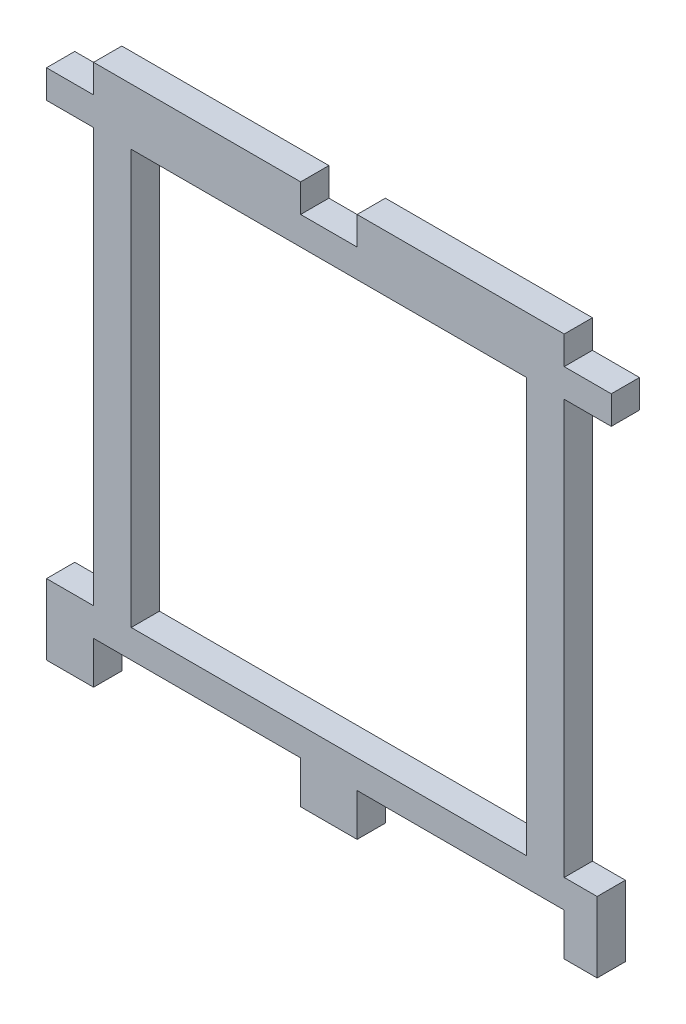
ISO-10303-21;
HEADER;
FILE_DESCRIPTION(('STEP AP214'),'2;1');
FILE_NAME('part.step','',(''),(''),'','','');
FILE_SCHEMA(('AUTOMOTIVE_DESIGN { 1 0 10303 214 1 1 1 1 }'));
ENDSEC;
DATA;
#1=APPLICATION_CONTEXT('core data for automotive mechanical design processes');
#2=APPLICATION_PROTOCOL_DEFINITION('international standard','automotive_design',2000,#1);
#3=PRODUCT_CONTEXT('',#1,'mechanical');
#4=PRODUCT('Part','Part','',(#3));
#5=PRODUCT_RELATED_PRODUCT_CATEGORY('part','',(#4));
#6=PRODUCT_DEFINITION_FORMATION('','',#4);
#7=PRODUCT_DEFINITION_CONTEXT('part definition',#1,'design');
#8=PRODUCT_DEFINITION('design','',#6,#7);
#9=PRODUCT_DEFINITION_SHAPE('','',#8);
#10=(LENGTH_UNIT() NAMED_UNIT(*) SI_UNIT(.MILLI.,.METRE.));
#11=(NAMED_UNIT(*) PLANE_ANGLE_UNIT() SI_UNIT($,.RADIAN.));
#12=(NAMED_UNIT(*) SI_UNIT($,.STERADIAN.) SOLID_ANGLE_UNIT());
#13=UNCERTAINTY_MEASURE_WITH_UNIT(LENGTH_MEASURE(1.E-05),#10,'distance_accuracy_value','');
#14=(GEOMETRIC_REPRESENTATION_CONTEXT(3) GLOBAL_UNCERTAINTY_ASSIGNED_CONTEXT((#13)) GLOBAL_UNIT_ASSIGNED_CONTEXT((#10,
#11,#12)) REPRESENTATION_CONTEXT('',''));
#15=CARTESIAN_POINT('',(0.,0.,0.));
#16=DIRECTION('',(0.,0.,1.));
#17=DIRECTION('',(1.,0.,0.));
#18=AXIS2_PLACEMENT_3D('',#15,#16,#17);
#19=CARTESIAN_POINT('',(0.,0.,3.));
#20=DIRECTION('',(0.,0.,1.));
#21=DIRECTION('',(1.,0.,0.));
#22=AXIS2_PLACEMENT_3D('',#19,#20,#21);
#23=PLANE('',#22);
#24=DIRECTION('',(0.,-1.,0.));
#25=VECTOR('',#24,1.);
#26=CARTESIAN_POINT('',(0.,0.,3.));
#27=LINE('',#26,#25);
#28=CARTESIAN_POINT('',(0.,0.,3.));
#29=VERTEX_POINT('',#28);
#30=CARTESIAN_POINT('',(0.,-3.,3.));
#31=VERTEX_POINT('',#30);
#32=EDGE_CURVE('E280',#29,#31,#27,.T.);
#33=ORIENTED_EDGE('',*,*,#32,.T.);
#34=DIRECTION('',(1.,0.,0.));
#35=VECTOR('',#34,1.);
#36=CARTESIAN_POINT('',(0.,-3.,3.));
#37=LINE('',#36,#35);
#38=CARTESIAN_POINT('',(5.,-3.00000000000001,3.));
#39=VERTEX_POINT('',#38);
#40=EDGE_CURVE('E283',#31,#39,#37,.T.);
#41=ORIENTED_EDGE('',*,*,#40,.T.);
#42=DIRECTION('',(0.,-1.,0.));
#43=VECTOR('',#42,1.);
#44=CARTESIAN_POINT('',(5.,-3.00000000000001,3.));
#45=LINE('',#44,#43);
#46=CARTESIAN_POINT('',(5.,-47.,3.));
#47=VERTEX_POINT('',#46);
#48=EDGE_CURVE('E286',#39,#47,#45,.T.);
#49=ORIENTED_EDGE('',*,*,#48,.T.);
#50=DIRECTION('',(-1.,0.,0.));
#51=VECTOR('',#50,1.);
#52=CARTESIAN_POINT('',(0.,-47.,3.));
#53=LINE('',#52,#51);
#54=CARTESIAN_POINT('',(0.,-47.,3.));
#55=VERTEX_POINT('',#54);
#56=EDGE_CURVE('E288',#47,#55,#53,.T.);
#57=ORIENTED_EDGE('',*,*,#56,.T.);
#58=DIRECTION('',(0.,-1.,0.));
#59=VECTOR('',#58,1.);
#60=CARTESIAN_POINT('',(0.,-54.5,3.));
#61=LINE('',#60,#59);
#62=CARTESIAN_POINT('',(0.,-54.5,3.));
#63=VERTEX_POINT('',#62);
#64=EDGE_CURVE('E290',#55,#63,#61,.T.);
#65=ORIENTED_EDGE('',*,*,#64,.T.);
#66=DIRECTION('',(1.,0.,0.));
#67=VECTOR('',#66,1.);
#68=CARTESIAN_POINT('',(5.00000000000001,-54.5,3.));
#69=LINE('',#68,#67);
#70=CARTESIAN_POINT('',(5.00000000000001,-54.5,3.));
#71=VERTEX_POINT('',#70);
#72=EDGE_CURVE('E292',#63,#71,#69,.T.);
#73=ORIENTED_EDGE('',*,*,#72,.T.);
#74=DIRECTION('',(0.,1.,0.));
#75=VECTOR('',#74,1.);
#76=CARTESIAN_POINT('',(5.00000000000001,-50.,3.));
#77=LINE('',#76,#75);
#78=CARTESIAN_POINT('',(5.00000000000001,-50.,3.));
#79=VERTEX_POINT('',#78);
#80=EDGE_CURVE('E294',#71,#79,#77,.T.);
#81=ORIENTED_EDGE('',*,*,#80,.T.);
#82=DIRECTION('',(1.,0.,0.));
#83=VECTOR('',#82,1.);
#84=CARTESIAN_POINT('',(27.,-50.,3.));
#85=LINE('',#84,#83);
#86=CARTESIAN_POINT('',(27.,-50.,3.));
#87=VERTEX_POINT('',#86);
#88=EDGE_CURVE('E296',#79,#87,#85,.T.);
#89=ORIENTED_EDGE('',*,*,#88,.T.);
#90=DIRECTION('',(0.,-1.,0.));
#91=VECTOR('',#90,1.);
#92=CARTESIAN_POINT('',(27.,-54.5,3.));
#93=LINE('',#92,#91);
#94=CARTESIAN_POINT('',(27.,-54.5,3.));
#95=VERTEX_POINT('',#94);
#96=EDGE_CURVE('E298',#87,#95,#93,.T.);
#97=ORIENTED_EDGE('',*,*,#96,.T.);
#98=DIRECTION('',(1.,0.,0.));
#99=VECTOR('',#98,1.);
#100=CARTESIAN_POINT('',(33.,-54.5,3.));
#101=LINE('',#100,#99);
#102=CARTESIAN_POINT('',(33.,-54.5,3.));
#103=VERTEX_POINT('',#102);
#104=EDGE_CURVE('E300',#95,#103,#101,.T.);
#105=ORIENTED_EDGE('',*,*,#104,.T.);
#106=DIRECTION('',(0.,1.,0.));
#107=VECTOR('',#106,1.);
#108=CARTESIAN_POINT('',(33.,-50.,3.));
#109=LINE('',#108,#107);
#110=CARTESIAN_POINT('',(33.,-50.,3.));
#111=VERTEX_POINT('',#110);
#112=EDGE_CURVE('E302',#103,#111,#109,.T.);
#113=ORIENTED_EDGE('',*,*,#112,.T.);
#114=DIRECTION('',(1.,0.,0.));
#115=VECTOR('',#114,1.);
#116=CARTESIAN_POINT('',(55.,-50.,3.));
#117=LINE('',#116,#115);
#118=CARTESIAN_POINT('',(55.,-50.,3.));
#119=VERTEX_POINT('',#118);
#120=EDGE_CURVE('E304',#111,#119,#117,.T.);
#121=ORIENTED_EDGE('',*,*,#120,.T.);
#122=DIRECTION('',(0.,-1.,0.));
#123=VECTOR('',#122,1.);
#124=CARTESIAN_POINT('',(55.,-54.5,3.));
#125=LINE('',#124,#123);
#126=CARTESIAN_POINT('',(55.,-54.5,3.));
#127=VERTEX_POINT('',#126);
#128=EDGE_CURVE('E306',#119,#127,#125,.T.);
#129=ORIENTED_EDGE('',*,*,#128,.T.);
#130=DIRECTION('',(1.,0.,0.));
#131=VECTOR('',#130,1.);
#132=CARTESIAN_POINT('',(58.5,-54.5,3.));
#133=LINE('',#132,#131);
#134=CARTESIAN_POINT('',(58.5,-54.5,3.));
#135=VERTEX_POINT('',#134);
#136=EDGE_CURVE('E308',#127,#135,#133,.T.);
#137=ORIENTED_EDGE('',*,*,#136,.T.);
#138=DIRECTION('',(0.,1.,0.));
#139=VECTOR('',#138,1.);
#140=CARTESIAN_POINT('',(58.5,-47.,3.));
#141=LINE('',#140,#139);
#142=CARTESIAN_POINT('',(58.5,-47.,3.));
#143=VERTEX_POINT('',#142);
#144=EDGE_CURVE('E310',#135,#143,#141,.T.);
#145=ORIENTED_EDGE('',*,*,#144,.T.);
#146=DIRECTION('',(-1.,0.,0.));
#147=VECTOR('',#146,1.);
#148=CARTESIAN_POINT('',(55.,-47.,3.));
#149=LINE('',#148,#147);
#150=CARTESIAN_POINT('',(55.,-47.,3.));
#151=VERTEX_POINT('',#150);
#152=EDGE_CURVE('E312',#143,#151,#149,.T.);
#153=ORIENTED_EDGE('',*,*,#152,.T.);
#154=DIRECTION('',(0.,1.,0.));
#155=VECTOR('',#154,1.);
#156=CARTESIAN_POINT('',(55.,-3.,3.));
#157=LINE('',#156,#155);
#158=CARTESIAN_POINT('',(55.,-3.,3.));
#159=VERTEX_POINT('',#158);
#160=EDGE_CURVE('E314',#151,#159,#157,.T.);
#161=ORIENTED_EDGE('',*,*,#160,.T.);
#162=DIRECTION('',(1.,0.,0.));
#163=VECTOR('',#162,1.);
#164=CARTESIAN_POINT('',(60.,-3.,3.));
#165=LINE('',#164,#163);
#166=CARTESIAN_POINT('',(60.,-3.,3.));
#167=VERTEX_POINT('',#166);
#168=EDGE_CURVE('E316',#159,#167,#165,.T.);
#169=ORIENTED_EDGE('',*,*,#168,.T.);
#170=DIRECTION('',(0.,1.,0.));
#171=VECTOR('',#170,1.);
#172=CARTESIAN_POINT('',(60.,0.,3.));
#173=LINE('',#172,#171);
#174=CARTESIAN_POINT('',(60.,0.,3.));
#175=VERTEX_POINT('',#174);
#176=EDGE_CURVE('E318',#167,#175,#173,.T.);
#177=ORIENTED_EDGE('',*,*,#176,.T.);
#178=DIRECTION('',(-1.,0.,0.));
#179=VECTOR('',#178,1.);
#180=CARTESIAN_POINT('',(55.,0.,3.));
#181=LINE('',#180,#179);
#182=CARTESIAN_POINT('',(55.,0.,3.));
#183=VERTEX_POINT('',#182);
#184=EDGE_CURVE('E320',#175,#183,#181,.T.);
#185=ORIENTED_EDGE('',*,*,#184,.T.);
#186=DIRECTION('',(0.,1.,0.));
#187=VECTOR('',#186,1.);
#188=CARTESIAN_POINT('',(55.,3.,3.));
#189=LINE('',#188,#187);
#190=CARTESIAN_POINT('',(55.,3.,3.));
#191=VERTEX_POINT('',#190);
#192=EDGE_CURVE('E322',#183,#191,#189,.T.);
#193=ORIENTED_EDGE('',*,*,#192,.T.);
#194=DIRECTION('',(-1.,0.,0.));
#195=VECTOR('',#194,1.);
#196=CARTESIAN_POINT('',(33.,3.,3.));
#197=LINE('',#196,#195);
#198=CARTESIAN_POINT('',(33.,3.,3.));
#199=VERTEX_POINT('',#198);
#200=EDGE_CURVE('E324',#191,#199,#197,.T.);
#201=ORIENTED_EDGE('',*,*,#200,.T.);
#202=DIRECTION('',(0.,-1.,0.));
#203=VECTOR('',#202,1.);
#204=CARTESIAN_POINT('',(33.,0.,3.));
#205=LINE('',#204,#203);
#206=CARTESIAN_POINT('',(33.,0.,3.));
#207=VERTEX_POINT('',#206);
#208=EDGE_CURVE('E326',#199,#207,#205,.T.);
#209=ORIENTED_EDGE('',*,*,#208,.T.);
#210=DIRECTION('',(-1.,0.,0.));
#211=VECTOR('',#210,1.);
#212=CARTESIAN_POINT('',(27.,0.,3.));
#213=LINE('',#212,#211);
#214=CARTESIAN_POINT('',(27.,0.,3.));
#215=VERTEX_POINT('',#214);
#216=EDGE_CURVE('E328',#207,#215,#213,.T.);
#217=ORIENTED_EDGE('',*,*,#216,.T.);
#218=DIRECTION('',(0.,1.,0.));
#219=VECTOR('',#218,1.);
#220=CARTESIAN_POINT('',(27.,3.,3.));
#221=LINE('',#220,#219);
#222=CARTESIAN_POINT('',(27.,3.,3.));
#223=VERTEX_POINT('',#222);
#224=EDGE_CURVE('E330',#215,#223,#221,.T.);
#225=ORIENTED_EDGE('',*,*,#224,.T.);
#226=DIRECTION('',(-1.,0.,0.));
#227=VECTOR('',#226,1.);
#228=CARTESIAN_POINT('',(5.,3.,3.));
#229=LINE('',#228,#227);
#230=CARTESIAN_POINT('',(5.,3.,3.));
#231=VERTEX_POINT('',#230);
#232=EDGE_CURVE('E332',#223,#231,#229,.T.);
#233=ORIENTED_EDGE('',*,*,#232,.T.);
#234=DIRECTION('',(0.,-1.,0.));
#235=VECTOR('',#234,1.);
#236=CARTESIAN_POINT('',(5.,0.,3.));
#237=LINE('',#236,#235);
#238=CARTESIAN_POINT('',(5.,0.,3.));
#239=VERTEX_POINT('',#238);
#240=EDGE_CURVE('E334',#231,#239,#237,.T.);
#241=ORIENTED_EDGE('',*,*,#240,.T.);
#242=DIRECTION('',(-1.,0.,0.));
#243=VECTOR('',#242,1.);
#244=CARTESIAN_POINT('',(0.,0.,3.));
#245=LINE('',#244,#243);
#246=EDGE_CURVE('E336',#239,#29,#245,.T.);
#247=ORIENTED_EDGE('',*,*,#246,.T.);
#248=EDGE_LOOP('',(#33,#41,#49,#57,#65,#73,#81,#89,#97,#105,#113,#121,#129,#137,#145,#153,#161,
#169,#177,#185,#193,#201,#209,#217,#225,#233,#241,#247));
#249=FACE_BOUND('',#248,.T.);
#250=DIRECTION('',(-1.,0.,0.));
#251=VECTOR('',#250,1.);
#252=CARTESIAN_POINT('',(51.,-3.,3.));
#253=LINE('',#252,#251);
#254=CARTESIAN_POINT('',(51.,-3.,3.));
#255=VERTEX_POINT('',#254);
#256=CARTESIAN_POINT('',(9.,-3.00000000000001,3.));
#257=VERTEX_POINT('',#256);
#258=EDGE_CURVE('E252',#255,#257,#253,.T.);
#259=ORIENTED_EDGE('',*,*,#258,.F.);
#260=DIRECTION('',(0.,1.,0.));
#261=VECTOR('',#260,1.);
#262=CARTESIAN_POINT('',(51.,-47.,3.));
#263=LINE('',#262,#261);
#264=CARTESIAN_POINT('',(51.,-47.,3.));
#265=VERTEX_POINT('',#264);
#266=EDGE_CURVE('E244',#265,#255,#263,.T.);
#267=ORIENTED_EDGE('',*,*,#266,.F.);
#268=DIRECTION('',(1.,0.,0.));
#269=VECTOR('',#268,1.);
#270=CARTESIAN_POINT('',(9.00000000000001,-47.,3.));
#271=LINE('',#270,#269);
#272=CARTESIAN_POINT('',(9.00000000000001,-47.,3.));
#273=VERTEX_POINT('',#272);
#274=EDGE_CURVE('E266',#273,#265,#271,.T.);
#275=ORIENTED_EDGE('',*,*,#274,.F.);
#276=DIRECTION('',(0.,-1.,0.));
#277=VECTOR('',#276,1.);
#278=CARTESIAN_POINT('',(9.,-3.00000000000001,3.));
#279=LINE('',#278,#277);
#280=EDGE_CURVE('E264',#257,#273,#279,.T.);
#281=ORIENTED_EDGE('',*,*,#280,.F.);
#282=EDGE_LOOP('',(#259,#267,#275,#281));
#283=FACE_BOUND('',#282,.T.);
#284=ADVANCED_FACE('F35',(#249,#283),#23,.T.);
#285=CARTESIAN_POINT('',(0.,0.,0.));
#286=DIRECTION('',(0.,0.,1.));
#287=DIRECTION('',(1.,0.,0.));
#288=AXIS2_PLACEMENT_3D('',#285,#286,#287);
#289=PLANE('',#288);
#290=DIRECTION('',(0.,-1.,0.));
#291=VECTOR('',#290,1.);
#292=CARTESIAN_POINT('',(0.,0.,0.));
#293=LINE('',#292,#291);
#294=CARTESIAN_POINT('',(0.,0.,0.));
#295=VERTEX_POINT('',#294);
#296=CARTESIAN_POINT('',(0.,-3.,0.));
#297=VERTEX_POINT('',#296);
#298=EDGE_CURVE('E260',#295,#297,#293,.T.);
#299=ORIENTED_EDGE('',*,*,#298,.F.);
#300=DIRECTION('',(-1.,0.,0.));
#301=VECTOR('',#300,1.);
#302=CARTESIAN_POINT('',(0.,0.,0.));
#303=LINE('',#302,#301);
#304=CARTESIAN_POINT('',(5.,0.,0.));
#305=VERTEX_POINT('',#304);
#306=EDGE_CURVE('E284',#305,#295,#303,.T.);
#307=ORIENTED_EDGE('',*,*,#306,.F.);
#308=DIRECTION('',(0.,-1.,0.));
#309=VECTOR('',#308,1.);
#310=CARTESIAN_POINT('',(5.,0.,0.));
#311=LINE('',#310,#309);
#312=CARTESIAN_POINT('',(5.,3.,0.));
#313=VERTEX_POINT('',#312);
#314=EDGE_CURVE('E391',#313,#305,#311,.T.);
#315=ORIENTED_EDGE('',*,*,#314,.F.);
#316=DIRECTION('',(-1.,0.,0.));
#317=VECTOR('',#316,1.);
#318=CARTESIAN_POINT('',(5.,3.,0.));
#319=LINE('',#318,#317);
#320=CARTESIAN_POINT('',(27.,3.,0.));
#321=VERTEX_POINT('',#320);
#322=EDGE_CURVE('E389',#321,#313,#319,.T.);
#323=ORIENTED_EDGE('',*,*,#322,.F.);
#324=DIRECTION('',(0.,1.,0.));
#325=VECTOR('',#324,1.);
#326=CARTESIAN_POINT('',(27.,3.,0.));
#327=LINE('',#326,#325);
#328=CARTESIAN_POINT('',(27.,0.,0.));
#329=VERTEX_POINT('',#328);
#330=EDGE_CURVE('E387',#329,#321,#327,.T.);
#331=ORIENTED_EDGE('',*,*,#330,.F.);
#332=DIRECTION('',(-1.,0.,0.));
#333=VECTOR('',#332,1.);
#334=CARTESIAN_POINT('',(27.,0.,0.));
#335=LINE('',#334,#333);
#336=CARTESIAN_POINT('',(33.,0.,0.));
#337=VERTEX_POINT('',#336);
#338=EDGE_CURVE('E385',#337,#329,#335,.T.);
#339=ORIENTED_EDGE('',*,*,#338,.F.);
#340=DIRECTION('',(0.,-1.,0.));
#341=VECTOR('',#340,1.);
#342=CARTESIAN_POINT('',(33.,0.,0.));
#343=LINE('',#342,#341);
#344=CARTESIAN_POINT('',(33.,3.,0.));
#345=VERTEX_POINT('',#344);
#346=EDGE_CURVE('E383',#345,#337,#343,.T.);
#347=ORIENTED_EDGE('',*,*,#346,.F.);
#348=DIRECTION('',(-1.,0.,0.));
#349=VECTOR('',#348,1.);
#350=CARTESIAN_POINT('',(33.,3.,0.));
#351=LINE('',#350,#349);
#352=CARTESIAN_POINT('',(55.,3.,0.));
#353=VERTEX_POINT('',#352);
#354=EDGE_CURVE('E381',#353,#345,#351,.T.);
#355=ORIENTED_EDGE('',*,*,#354,.F.);
#356=DIRECTION('',(0.,1.,0.));
#357=VECTOR('',#356,1.);
#358=CARTESIAN_POINT('',(55.,3.,0.));
#359=LINE('',#358,#357);
#360=CARTESIAN_POINT('',(55.,0.,0.));
#361=VERTEX_POINT('',#360);
#362=EDGE_CURVE('E379',#361,#353,#359,.T.);
#363=ORIENTED_EDGE('',*,*,#362,.F.);
#364=DIRECTION('',(-1.,0.,0.));
#365=VECTOR('',#364,1.);
#366=CARTESIAN_POINT('',(55.,0.,0.));
#367=LINE('',#366,#365);
#368=CARTESIAN_POINT('',(60.,0.,0.));
#369=VERTEX_POINT('',#368);
#370=EDGE_CURVE('E377',#369,#361,#367,.T.);
#371=ORIENTED_EDGE('',*,*,#370,.F.);
#372=DIRECTION('',(0.,1.,0.));
#373=VECTOR('',#372,1.);
#374=CARTESIAN_POINT('',(60.,0.,0.));
#375=LINE('',#374,#373);
#376=CARTESIAN_POINT('',(60.,-3.,0.));
#377=VERTEX_POINT('',#376);
#378=EDGE_CURVE('E375',#377,#369,#375,.T.);
#379=ORIENTED_EDGE('',*,*,#378,.F.);
#380=DIRECTION('',(1.,0.,0.));
#381=VECTOR('',#380,1.);
#382=CARTESIAN_POINT('',(60.,-3.,0.));
#383=LINE('',#382,#381);
#384=CARTESIAN_POINT('',(55.,-3.,0.));
#385=VERTEX_POINT('',#384);
#386=EDGE_CURVE('E373',#385,#377,#383,.T.);
#387=ORIENTED_EDGE('',*,*,#386,.F.);
#388=DIRECTION('',(0.,1.,0.));
#389=VECTOR('',#388,1.);
#390=CARTESIAN_POINT('',(55.,-3.,0.));
#391=LINE('',#390,#389);
#392=CARTESIAN_POINT('',(55.,-47.,0.));
#393=VERTEX_POINT('',#392);
#394=EDGE_CURVE('E371',#393,#385,#391,.T.);
#395=ORIENTED_EDGE('',*,*,#394,.F.);
#396=DIRECTION('',(-1.,0.,0.));
#397=VECTOR('',#396,1.);
#398=CARTESIAN_POINT('',(55.,-47.,0.));
#399=LINE('',#398,#397);
#400=CARTESIAN_POINT('',(58.5,-47.,0.));
#401=VERTEX_POINT('',#400);
#402=EDGE_CURVE('E369',#401,#393,#399,.T.);
#403=ORIENTED_EDGE('',*,*,#402,.F.);
#404=DIRECTION('',(0.,1.,0.));
#405=VECTOR('',#404,1.);
#406=CARTESIAN_POINT('',(58.5,-47.,0.));
#407=LINE('',#406,#405);
#408=CARTESIAN_POINT('',(58.5,-54.5,0.));
#409=VERTEX_POINT('',#408);
#410=EDGE_CURVE('E367',#409,#401,#407,.T.);
#411=ORIENTED_EDGE('',*,*,#410,.F.);
#412=DIRECTION('',(1.,0.,0.));
#413=VECTOR('',#412,1.);
#414=CARTESIAN_POINT('',(58.5,-54.5,0.));
#415=LINE('',#414,#413);
#416=CARTESIAN_POINT('',(55.,-54.5,0.));
#417=VERTEX_POINT('',#416);
#418=EDGE_CURVE('E365',#417,#409,#415,.T.);
#419=ORIENTED_EDGE('',*,*,#418,.F.);
#420=DIRECTION('',(0.,-1.,0.));
#421=VECTOR('',#420,1.);
#422=CARTESIAN_POINT('',(55.,-54.5,0.));
#423=LINE('',#422,#421);
#424=CARTESIAN_POINT('',(55.,-50.,0.));
#425=VERTEX_POINT('',#424);
#426=EDGE_CURVE('E363',#425,#417,#423,.T.);
#427=ORIENTED_EDGE('',*,*,#426,.F.);
#428=DIRECTION('',(1.,0.,0.));
#429=VECTOR('',#428,1.);
#430=CARTESIAN_POINT('',(55.,-50.,0.));
#431=LINE('',#430,#429);
#432=CARTESIAN_POINT('',(33.,-50.,0.));
#433=VERTEX_POINT('',#432);
#434=EDGE_CURVE('E361',#433,#425,#431,.T.);
#435=ORIENTED_EDGE('',*,*,#434,.F.);
#436=DIRECTION('',(0.,1.,0.));
#437=VECTOR('',#436,1.);
#438=CARTESIAN_POINT('',(33.,-50.,0.));
#439=LINE('',#438,#437);
#440=CARTESIAN_POINT('',(33.,-54.5,0.));
#441=VERTEX_POINT('',#440);
#442=EDGE_CURVE('E359',#441,#433,#439,.T.);
#443=ORIENTED_EDGE('',*,*,#442,.F.);
#444=DIRECTION('',(1.,0.,0.));
#445=VECTOR('',#444,1.);
#446=CARTESIAN_POINT('',(33.,-54.5,0.));
#447=LINE('',#446,#445);
#448=CARTESIAN_POINT('',(27.,-54.5,0.));
#449=VERTEX_POINT('',#448);
#450=EDGE_CURVE('E357',#449,#441,#447,.T.);
#451=ORIENTED_EDGE('',*,*,#450,.F.);
#452=DIRECTION('',(0.,-1.,0.));
#453=VECTOR('',#452,1.);
#454=CARTESIAN_POINT('',(27.,-54.5,0.));
#455=LINE('',#454,#453);
#456=CARTESIAN_POINT('',(27.,-50.,0.));
#457=VERTEX_POINT('',#456);
#458=EDGE_CURVE('E355',#457,#449,#455,.T.);
#459=ORIENTED_EDGE('',*,*,#458,.F.);
#460=DIRECTION('',(1.,0.,0.));
#461=VECTOR('',#460,1.);
#462=CARTESIAN_POINT('',(27.,-50.,0.));
#463=LINE('',#462,#461);
#464=CARTESIAN_POINT('',(5.00000000000001,-50.,0.));
#465=VERTEX_POINT('',#464);
#466=EDGE_CURVE('E353',#465,#457,#463,.T.);
#467=ORIENTED_EDGE('',*,*,#466,.F.);
#468=DIRECTION('',(0.,1.,0.));
#469=VECTOR('',#468,1.);
#470=CARTESIAN_POINT('',(5.00000000000001,-50.,0.));
#471=LINE('',#470,#469);
#472=CARTESIAN_POINT('',(5.00000000000001,-54.5,0.));
#473=VERTEX_POINT('',#472);
#474=EDGE_CURVE('E351',#473,#465,#471,.T.);
#475=ORIENTED_EDGE('',*,*,#474,.F.);
#476=DIRECTION('',(1.,0.,0.));
#477=VECTOR('',#476,1.);
#478=CARTESIAN_POINT('',(5.00000000000001,-54.5,0.));
#479=LINE('',#478,#477);
#480=CARTESIAN_POINT('',(0.,-54.5,0.));
#481=VERTEX_POINT('',#480);
#482=EDGE_CURVE('E349',#481,#473,#479,.T.);
#483=ORIENTED_EDGE('',*,*,#482,.F.);
#484=DIRECTION('',(0.,-1.,0.));
#485=VECTOR('',#484,1.);
#486=CARTESIAN_POINT('',(0.,-54.5,0.));
#487=LINE('',#486,#485);
#488=CARTESIAN_POINT('',(0.,-47.,0.));
#489=VERTEX_POINT('',#488);
#490=EDGE_CURVE('E347',#489,#481,#487,.T.);
#491=ORIENTED_EDGE('',*,*,#490,.F.);
#492=DIRECTION('',(-1.,0.,0.));
#493=VECTOR('',#492,1.);
#494=CARTESIAN_POINT('',(0.,-47.,0.));
#495=LINE('',#494,#493);
#496=CARTESIAN_POINT('',(5.,-47.,0.));
#497=VERTEX_POINT('',#496);
#498=EDGE_CURVE('E345',#497,#489,#495,.T.);
#499=ORIENTED_EDGE('',*,*,#498,.F.);
#500=DIRECTION('',(0.,-1.,0.));
#501=VECTOR('',#500,1.);
#502=CARTESIAN_POINT('',(5.,-3.00000000000001,0.));
#503=LINE('',#502,#501);
#504=CARTESIAN_POINT('',(5.,-3.00000000000001,0.));
#505=VERTEX_POINT('',#504);
#506=EDGE_CURVE('E343',#505,#497,#503,.T.);
#507=ORIENTED_EDGE('',*,*,#506,.F.);
#508=DIRECTION('',(1.,0.,0.));
#509=VECTOR('',#508,1.);
#510=CARTESIAN_POINT('',(0.,-3.,0.));
#511=LINE('',#510,#509);
#512=EDGE_CURVE('E341',#297,#505,#511,.T.);
#513=ORIENTED_EDGE('',*,*,#512,.F.);
#514=EDGE_LOOP('',(#299,#307,#315,#323,#331,#339,#347,#355,#363,#371,#379,#387,#395,#403,#411,
#419,#427,#435,#443,#451,#459,#467,#475,#483,#491,#499,#507,#513));
#515=FACE_BOUND('',#514,.T.);
#516=DIRECTION('',(0.,1.,0.));
#517=VECTOR('',#516,1.);
#518=CARTESIAN_POINT('',(51.,-47.,0.));
#519=LINE('',#518,#517);
#520=CARTESIAN_POINT('',(51.,-47.,0.));
#521=VERTEX_POINT('',#520);
#522=CARTESIAN_POINT('',(51.,-3.,0.));
#523=VERTEX_POINT('',#522);
#524=EDGE_CURVE('E58',#521,#523,#519,.T.);
#525=ORIENTED_EDGE('',*,*,#524,.T.);
#526=DIRECTION('',(-1.,0.,0.));
#527=VECTOR('',#526,1.);
#528=CARTESIAN_POINT('',(51.,-3.,0.));
#529=LINE('',#528,#527);
#530=CARTESIAN_POINT('',(9.,-3.00000000000001,0.));
#531=VERTEX_POINT('',#530);
#532=EDGE_CURVE('E259',#523,#531,#529,.T.);
#533=ORIENTED_EDGE('',*,*,#532,.T.);
#534=DIRECTION('',(0.,-1.,0.));
#535=VECTOR('',#534,1.);
#536=CARTESIAN_POINT('',(9.,-3.00000000000001,0.));
#537=LINE('',#536,#535);
#538=CARTESIAN_POINT('',(9.00000000000001,-47.,0.));
#539=VERTEX_POINT('',#538);
#540=EDGE_CURVE('E272',#531,#539,#537,.T.);
#541=ORIENTED_EDGE('',*,*,#540,.T.);
#542=DIRECTION('',(1.,0.,0.));
#543=VECTOR('',#542,1.);
#544=CARTESIAN_POINT('',(9.00000000000001,-47.,0.));
#545=LINE('',#544,#543);
#546=EDGE_CURVE('E253',#539,#521,#545,.T.);
#547=ORIENTED_EDGE('',*,*,#546,.T.);
#548=EDGE_LOOP('',(#525,#533,#541,#547));
#549=FACE_BOUND('',#548,.T.);
#550=ADVANCED_FACE('F481',(#515,#549),#289,.F.);
#551=CARTESIAN_POINT('',(0.,0.,3.));
#552=DIRECTION('',(1.,0.,0.));
#553=DIRECTION('',(0.,0.,-1.));
#554=AXIS2_PLACEMENT_3D('',#551,#552,#553);
#555=PLANE('',#554);
#556=ORIENTED_EDGE('',*,*,#298,.T.);
#557=DIRECTION('',(0.,0.,-1.));
#558=VECTOR('',#557,1.);
#559=CARTESIAN_POINT('',(0.,-3.,3.));
#560=LINE('',#559,#558);
#561=EDGE_CURVE('E11',#31,#297,#560,.T.);
#562=ORIENTED_EDGE('',*,*,#561,.F.);
#563=ORIENTED_EDGE('',*,*,#32,.F.);
#564=DIRECTION('',(0.,0.,-1.));
#565=VECTOR('',#564,1.);
#566=CARTESIAN_POINT('',(0.,0.,3.));
#567=LINE('',#566,#565);
#568=EDGE_CURVE('E338',#29,#295,#567,.T.);
#569=ORIENTED_EDGE('',*,*,#568,.T.);
#570=EDGE_LOOP('',(#556,#562,#563,#569));
#571=FACE_BOUND('',#570,.T.);
#572=ADVANCED_FACE('F37',(#571),#555,.F.);
#573=CARTESIAN_POINT('',(0.,-3.,3.));
#574=DIRECTION('',(0.,1.,0.));
#575=DIRECTION('',(-1.,0.,0.));
#576=AXIS2_PLACEMENT_3D('',#573,#574,#575);
#577=PLANE('',#576);
#578=ORIENTED_EDGE('',*,*,#512,.T.);
#579=DIRECTION('',(0.,0.,-1.));
#580=VECTOR('',#579,1.);
#581=CARTESIAN_POINT('',(5.,-3.00000000000001,3.));
#582=LINE('',#581,#580);
#583=EDGE_CURVE('E43',#39,#505,#582,.T.);
#584=ORIENTED_EDGE('',*,*,#583,.F.);
#585=ORIENTED_EDGE('',*,*,#40,.F.);
#586=ORIENTED_EDGE('',*,*,#561,.T.);
#587=EDGE_LOOP('',(#578,#584,#585,#586));
#588=FACE_BOUND('',#587,.T.);
#589=ADVANCED_FACE('F498',(#588),#577,.F.);
#590=CARTESIAN_POINT('',(5.,-3.00000000000001,3.));
#591=DIRECTION('',(1.,0.,0.));
#592=DIRECTION('',(0.,1.,0.));
#593=AXIS2_PLACEMENT_3D('',#590,#591,#592);
#594=PLANE('',#593);
#595=ORIENTED_EDGE('',*,*,#506,.T.);
#596=DIRECTION('',(0.,0.,-1.));
#597=VECTOR('',#596,1.);
#598=CARTESIAN_POINT('',(5.,-47.,3.));
#599=LINE('',#598,#597);
#600=EDGE_CURVE('E468',#47,#497,#599,.T.);
#601=ORIENTED_EDGE('',*,*,#600,.F.);
#602=ORIENTED_EDGE('',*,*,#48,.F.);
#603=ORIENTED_EDGE('',*,*,#583,.T.);
#604=EDGE_LOOP('',(#595,#601,#602,#603));
#605=FACE_BOUND('',#604,.T.);
#606=ADVANCED_FACE('F475',(#605),#594,.F.);
#607=CARTESIAN_POINT('',(0.,-47.,3.));
#608=DIRECTION('',(0.,-1.,0.));
#609=DIRECTION('',(0.,0.,-1.));
#610=AXIS2_PLACEMENT_3D('',#607,#608,#609);
#611=PLANE('',#610);
#612=ORIENTED_EDGE('',*,*,#498,.T.);
#613=DIRECTION('',(0.,0.,-1.));
#614=VECTOR('',#613,1.);
#615=CARTESIAN_POINT('',(0.,-47.,3.));
#616=LINE('',#615,#614);
#617=EDGE_CURVE('E465',#55,#489,#616,.T.);
#618=ORIENTED_EDGE('',*,*,#617,.F.);
#619=ORIENTED_EDGE('',*,*,#56,.F.);
#620=ORIENTED_EDGE('',*,*,#600,.T.);
#621=EDGE_LOOP('',(#612,#618,#619,#620));
#622=FACE_BOUND('',#621,.T.);
#623=ADVANCED_FACE('F487',(#622),#611,.F.);
#624=CARTESIAN_POINT('',(0.,-54.5,3.));
#625=DIRECTION('',(1.,0.,0.));
#626=DIRECTION('',(0.,0.,-1.));
#627=AXIS2_PLACEMENT_3D('',#624,#625,#626);
#628=PLANE('',#627);
#629=ORIENTED_EDGE('',*,*,#490,.T.);
#630=DIRECTION('',(0.,0.,-1.));
#631=VECTOR('',#630,1.);
#632=CARTESIAN_POINT('',(0.,-54.5,3.));
#633=LINE('',#632,#631);
#634=EDGE_CURVE('E462',#63,#481,#633,.T.);
#635=ORIENTED_EDGE('',*,*,#634,.F.);
#636=ORIENTED_EDGE('',*,*,#64,.F.);
#637=ORIENTED_EDGE('',*,*,#617,.T.);
#638=EDGE_LOOP('',(#629,#635,#636,#637));
#639=FACE_BOUND('',#638,.T.);
#640=ADVANCED_FACE('F491',(#639),#628,.F.);
#641=CARTESIAN_POINT('',(5.00000000000001,-54.5,3.));
#642=DIRECTION('',(0.,1.,0.));
#643=DIRECTION('',(0.,0.,1.));
#644=AXIS2_PLACEMENT_3D('',#641,#642,#643);
#645=PLANE('',#644);
#646=ORIENTED_EDGE('',*,*,#482,.T.);
#647=DIRECTION('',(0.,0.,-1.));
#648=VECTOR('',#647,1.);
#649=CARTESIAN_POINT('',(5.00000000000001,-54.5,3.));
#650=LINE('',#649,#648);
#651=EDGE_CURVE('E459',#71,#473,#650,.T.);
#652=ORIENTED_EDGE('',*,*,#651,.F.);
#653=ORIENTED_EDGE('',*,*,#72,.F.);
#654=ORIENTED_EDGE('',*,*,#634,.T.);
#655=EDGE_LOOP('',(#646,#652,#653,#654));
#656=FACE_BOUND('',#655,.T.);
#657=ADVANCED_FACE('F611',(#656),#645,.F.);
#658=CARTESIAN_POINT('',(5.00000000000001,-50.,3.));
#659=DIRECTION('',(-1.,0.,0.));
#660=DIRECTION('',(0.,-1.,0.));
#661=AXIS2_PLACEMENT_3D('',#658,#659,#660);
#662=PLANE('',#661);
#663=ORIENTED_EDGE('',*,*,#474,.T.);
#664=DIRECTION('',(0.,0.,-1.));
#665=VECTOR('',#664,1.);
#666=CARTESIAN_POINT('',(5.00000000000001,-50.,3.));
#667=LINE('',#666,#665);
#668=EDGE_CURVE('E456',#79,#465,#667,.T.);
#669=ORIENTED_EDGE('',*,*,#668,.F.);
#670=ORIENTED_EDGE('',*,*,#80,.F.);
#671=ORIENTED_EDGE('',*,*,#651,.T.);
#672=EDGE_LOOP('',(#663,#669,#670,#671));
#673=FACE_BOUND('',#672,.T.);
#674=ADVANCED_FACE('F608',(#673),#662,.F.);
#675=CARTESIAN_POINT('',(27.,-50.,3.));
#676=DIRECTION('',(0.,1.,0.));
#677=DIRECTION('',(0.,0.,1.));
#678=AXIS2_PLACEMENT_3D('',#675,#676,#677);
#679=PLANE('',#678);
#680=ORIENTED_EDGE('',*,*,#466,.T.);
#681=DIRECTION('',(0.,0.,-1.));
#682=VECTOR('',#681,1.);
#683=CARTESIAN_POINT('',(27.,-50.,3.));
#684=LINE('',#683,#682);
#685=EDGE_CURVE('E453',#87,#457,#684,.T.);
#686=ORIENTED_EDGE('',*,*,#685,.F.);
#687=ORIENTED_EDGE('',*,*,#88,.F.);
#688=ORIENTED_EDGE('',*,*,#668,.T.);
#689=EDGE_LOOP('',(#680,#686,#687,#688));
#690=FACE_BOUND('',#689,.T.);
#691=ADVANCED_FACE('F604',(#690),#679,.F.);
#692=CARTESIAN_POINT('',(27.,-54.5,3.));
#693=DIRECTION('',(1.,0.,0.));
#694=DIRECTION('',(0.,0.,-1.));
#695=AXIS2_PLACEMENT_3D('',#692,#693,#694);
#696=PLANE('',#695);
#697=ORIENTED_EDGE('',*,*,#458,.T.);
#698=DIRECTION('',(0.,0.,-1.));
#699=VECTOR('',#698,1.);
#700=CARTESIAN_POINT('',(27.,-54.5,3.));
#701=LINE('',#700,#699);
#702=EDGE_CURVE('E450',#95,#449,#701,.T.);
#703=ORIENTED_EDGE('',*,*,#702,.F.);
#704=ORIENTED_EDGE('',*,*,#96,.F.);
#705=ORIENTED_EDGE('',*,*,#685,.T.);
#706=EDGE_LOOP('',(#697,#703,#704,#705));
#707=FACE_BOUND('',#706,.T.);
#708=ADVANCED_FACE('F600',(#707),#696,.F.);
#709=CARTESIAN_POINT('',(33.,-54.5,3.));
#710=DIRECTION('',(0.,1.,0.));
#711=DIRECTION('',(-1.,0.,0.));
#712=AXIS2_PLACEMENT_3D('',#709,#710,#711);
#713=PLANE('',#712);
#714=ORIENTED_EDGE('',*,*,#450,.T.);
#715=DIRECTION('',(0.,0.,-1.));
#716=VECTOR('',#715,1.);
#717=CARTESIAN_POINT('',(33.,-54.5,3.));
#718=LINE('',#717,#716);
#719=EDGE_CURVE('E447',#103,#441,#718,.T.);
#720=ORIENTED_EDGE('',*,*,#719,.F.);
#721=ORIENTED_EDGE('',*,*,#104,.F.);
#722=ORIENTED_EDGE('',*,*,#702,.T.);
#723=EDGE_LOOP('',(#714,#720,#721,#722));
#724=FACE_BOUND('',#723,.T.);
#725=ADVANCED_FACE('F595',(#724),#713,.F.);
#726=CARTESIAN_POINT('',(33.,-50.,3.));
#727=DIRECTION('',(-1.,0.,0.));
#728=DIRECTION('',(0.,0.,1.));
#729=AXIS2_PLACEMENT_3D('',#726,#727,#728);
#730=PLANE('',#729);
#731=ORIENTED_EDGE('',*,*,#442,.T.);
#732=DIRECTION('',(0.,0.,-1.));
#733=VECTOR('',#732,1.);
#734=CARTESIAN_POINT('',(33.,-50.,3.));
#735=LINE('',#734,#733);
#736=EDGE_CURVE('E444',#111,#433,#735,.T.);
#737=ORIENTED_EDGE('',*,*,#736,.F.);
#738=ORIENTED_EDGE('',*,*,#112,.F.);
#739=ORIENTED_EDGE('',*,*,#719,.T.);
#740=EDGE_LOOP('',(#731,#737,#738,#739));
#741=FACE_BOUND('',#740,.T.);
#742=ADVANCED_FACE('F589',(#741),#730,.F.);
#743=CARTESIAN_POINT('',(55.,-50.,3.));
#744=DIRECTION('',(0.,1.,0.));
#745=DIRECTION('',(-1.,0.,0.));
#746=AXIS2_PLACEMENT_3D('',#743,#744,#745);
#747=PLANE('',#746);
#748=ORIENTED_EDGE('',*,*,#434,.T.);
#749=DIRECTION('',(0.,0.,-1.));
#750=VECTOR('',#749,1.);
#751=CARTESIAN_POINT('',(55.,-50.,3.));
#752=LINE('',#751,#750);
#753=EDGE_CURVE('E441',#119,#425,#752,.T.);
#754=ORIENTED_EDGE('',*,*,#753,.F.);
#755=ORIENTED_EDGE('',*,*,#120,.F.);
#756=ORIENTED_EDGE('',*,*,#736,.T.);
#757=EDGE_LOOP('',(#748,#754,#755,#756));
#758=FACE_BOUND('',#757,.T.);
#759=ADVANCED_FACE('F585',(#758),#747,.F.);
#760=CARTESIAN_POINT('',(55.,-54.5,3.));
#761=DIRECTION('',(1.,0.,0.));
#762=DIRECTION('',(0.,0.,-1.));
#763=AXIS2_PLACEMENT_3D('',#760,#761,#762);
#764=PLANE('',#763);
#765=ORIENTED_EDGE('',*,*,#426,.T.);
#766=DIRECTION('',(0.,0.,-1.));
#767=VECTOR('',#766,1.);
#768=CARTESIAN_POINT('',(55.,-54.5,3.));
#769=LINE('',#768,#767);
#770=EDGE_CURVE('E438',#127,#417,#769,.T.);
#771=ORIENTED_EDGE('',*,*,#770,.F.);
#772=ORIENTED_EDGE('',*,*,#128,.F.);
#773=ORIENTED_EDGE('',*,*,#753,.T.);
#774=EDGE_LOOP('',(#765,#771,#772,#773));
#775=FACE_BOUND('',#774,.T.);
#776=ADVANCED_FACE('F580',(#775),#764,.F.);
#777=CARTESIAN_POINT('',(58.5,-54.5,3.));
#778=DIRECTION('',(0.,1.,0.));
#779=DIRECTION('',(0.,0.,1.));
#780=AXIS2_PLACEMENT_3D('',#777,#778,#779);
#781=PLANE('',#780);
#782=ORIENTED_EDGE('',*,*,#418,.T.);
#783=DIRECTION('',(0.,0.,-1.));
#784=VECTOR('',#783,1.);
#785=CARTESIAN_POINT('',(58.5,-54.5,3.));
#786=LINE('',#785,#784);
#787=EDGE_CURVE('E435',#135,#409,#786,.T.);
#788=ORIENTED_EDGE('',*,*,#787,.F.);
#789=ORIENTED_EDGE('',*,*,#136,.F.);
#790=ORIENTED_EDGE('',*,*,#770,.T.);
#791=EDGE_LOOP('',(#782,#788,#789,#790));
#792=FACE_BOUND('',#791,.T.);
#793=ADVANCED_FACE('F574',(#792),#781,.F.);
#794=CARTESIAN_POINT('',(58.5,-47.,3.));
#795=DIRECTION('',(-1.,0.,0.));
#796=DIRECTION('',(0.,0.,1.));
#797=AXIS2_PLACEMENT_3D('',#794,#795,#796);
#798=PLANE('',#797);
#799=ORIENTED_EDGE('',*,*,#410,.T.);
#800=DIRECTION('',(0.,0.,-1.));
#801=VECTOR('',#800,1.);
#802=CARTESIAN_POINT('',(58.5,-47.,3.));
#803=LINE('',#802,#801);
#804=EDGE_CURVE('E432',#143,#401,#803,.T.);
#805=ORIENTED_EDGE('',*,*,#804,.F.);
#806=ORIENTED_EDGE('',*,*,#144,.F.);
#807=ORIENTED_EDGE('',*,*,#787,.T.);
#808=EDGE_LOOP('',(#799,#805,#806,#807));
#809=FACE_BOUND('',#808,.T.);
#810=ADVANCED_FACE('F570',(#809),#798,.F.);
#811=CARTESIAN_POINT('',(55.,-47.,3.));
#812=DIRECTION('',(0.,-1.,0.));
#813=DIRECTION('',(0.,0.,-1.));
#814=AXIS2_PLACEMENT_3D('',#811,#812,#813);
#815=PLANE('',#814);
#816=ORIENTED_EDGE('',*,*,#402,.T.);
#817=DIRECTION('',(0.,0.,-1.));
#818=VECTOR('',#817,1.);
#819=CARTESIAN_POINT('',(55.,-47.,3.));
#820=LINE('',#819,#818);
#821=EDGE_CURVE('E429',#151,#393,#820,.T.);
#822=ORIENTED_EDGE('',*,*,#821,.F.);
#823=ORIENTED_EDGE('',*,*,#152,.F.);
#824=ORIENTED_EDGE('',*,*,#804,.T.);
#825=EDGE_LOOP('',(#816,#822,#823,#824));
#826=FACE_BOUND('',#825,.T.);
#827=ADVANCED_FACE('F565',(#826),#815,.F.);
#828=CARTESIAN_POINT('',(55.,-3.,3.));
#829=DIRECTION('',(-1.,0.,0.));
#830=DIRECTION('',(0.,-1.,0.));
#831=AXIS2_PLACEMENT_3D('',#828,#829,#830);
#832=PLANE('',#831);
#833=ORIENTED_EDGE('',*,*,#394,.T.);
#834=DIRECTION('',(0.,0.,-1.));
#835=VECTOR('',#834,1.);
#836=CARTESIAN_POINT('',(55.,-3.,3.));
#837=LINE('',#836,#835);
#838=EDGE_CURVE('E426',#159,#385,#837,.T.);
#839=ORIENTED_EDGE('',*,*,#838,.F.);
#840=ORIENTED_EDGE('',*,*,#160,.F.);
#841=ORIENTED_EDGE('',*,*,#821,.T.);
#842=EDGE_LOOP('',(#833,#839,#840,#841));
#843=FACE_BOUND('',#842,.T.);
#844=ADVANCED_FACE('F559',(#843),#832,.F.);
#845=CARTESIAN_POINT('',(60.,-3.,3.));
#846=DIRECTION('',(0.,1.,0.));
#847=DIRECTION('',(-1.,0.,0.));
#848=AXIS2_PLACEMENT_3D('',#845,#846,#847);
#849=PLANE('',#848);
#850=ORIENTED_EDGE('',*,*,#386,.T.);
#851=DIRECTION('',(0.,0.,-1.));
#852=VECTOR('',#851,1.);
#853=CARTESIAN_POINT('',(60.,-3.,3.));
#854=LINE('',#853,#852);
#855=EDGE_CURVE('E423',#167,#377,#854,.T.);
#856=ORIENTED_EDGE('',*,*,#855,.F.);
#857=ORIENTED_EDGE('',*,*,#168,.F.);
#858=ORIENTED_EDGE('',*,*,#838,.T.);
#859=EDGE_LOOP('',(#850,#856,#857,#858));
#860=FACE_BOUND('',#859,.T.);
#861=ADVANCED_FACE('F555',(#860),#849,.F.);
#862=CARTESIAN_POINT('',(60.,0.,3.));
#863=DIRECTION('',(-1.,0.,0.));
#864=DIRECTION('',(0.,0.,1.));
#865=AXIS2_PLACEMENT_3D('',#862,#863,#864);
#866=PLANE('',#865);
#867=ORIENTED_EDGE('',*,*,#378,.T.);
#868=DIRECTION('',(0.,0.,-1.));
#869=VECTOR('',#868,1.);
#870=CARTESIAN_POINT('',(60.,0.,3.));
#871=LINE('',#870,#869);
#872=EDGE_CURVE('E420',#175,#369,#871,.T.);
#873=ORIENTED_EDGE('',*,*,#872,.F.);
#874=ORIENTED_EDGE('',*,*,#176,.F.);
#875=ORIENTED_EDGE('',*,*,#855,.T.);
#876=EDGE_LOOP('',(#867,#873,#874,#875));
#877=FACE_BOUND('',#876,.T.);
#878=ADVANCED_FACE('F550',(#877),#866,.F.);
#879=CARTESIAN_POINT('',(55.,0.,3.));
#880=DIRECTION('',(0.,-1.,0.));
#881=DIRECTION('',(0.,0.,-1.));
#882=AXIS2_PLACEMENT_3D('',#879,#880,#881);
#883=PLANE('',#882);
#884=ORIENTED_EDGE('',*,*,#370,.T.);
#885=DIRECTION('',(0.,0.,-1.));
#886=VECTOR('',#885,1.);
#887=CARTESIAN_POINT('',(55.,0.,3.));
#888=LINE('',#887,#886);
#889=EDGE_CURVE('E417',#183,#361,#888,.T.);
#890=ORIENTED_EDGE('',*,*,#889,.F.);
#891=ORIENTED_EDGE('',*,*,#184,.F.);
#892=ORIENTED_EDGE('',*,*,#872,.T.);
#893=EDGE_LOOP('',(#884,#890,#891,#892));
#894=FACE_BOUND('',#893,.T.);
#895=ADVANCED_FACE('F544',(#894),#883,.F.);
#896=CARTESIAN_POINT('',(55.,3.,3.));
#897=DIRECTION('',(-1.,0.,0.));
#898=DIRECTION('',(0.,-1.,0.));
#899=AXIS2_PLACEMENT_3D('',#896,#897,#898);
#900=PLANE('',#899);
#901=ORIENTED_EDGE('',*,*,#362,.T.);
#902=DIRECTION('',(0.,0.,-1.));
#903=VECTOR('',#902,1.);
#904=CARTESIAN_POINT('',(55.,3.,3.));
#905=LINE('',#904,#903);
#906=EDGE_CURVE('E414',#191,#353,#905,.T.);
#907=ORIENTED_EDGE('',*,*,#906,.F.);
#908=ORIENTED_EDGE('',*,*,#192,.F.);
#909=ORIENTED_EDGE('',*,*,#889,.T.);
#910=EDGE_LOOP('',(#901,#907,#908,#909));
#911=FACE_BOUND('',#910,.T.);
#912=ADVANCED_FACE('F540',(#911),#900,.F.);
#913=CARTESIAN_POINT('',(33.,3.,3.));
#914=DIRECTION('',(0.,-1.,0.));
#915=DIRECTION('',(0.,0.,-1.));
#916=AXIS2_PLACEMENT_3D('',#913,#914,#915);
#917=PLANE('',#916);
#918=ORIENTED_EDGE('',*,*,#354,.T.);
#919=DIRECTION('',(0.,0.,-1.));
#920=VECTOR('',#919,1.);
#921=CARTESIAN_POINT('',(33.,3.,3.));
#922=LINE('',#921,#920);
#923=EDGE_CURVE('E411',#199,#345,#922,.T.);
#924=ORIENTED_EDGE('',*,*,#923,.F.);
#925=ORIENTED_EDGE('',*,*,#200,.F.);
#926=ORIENTED_EDGE('',*,*,#906,.T.);
#927=EDGE_LOOP('',(#918,#924,#925,#926));
#928=FACE_BOUND('',#927,.T.);
#929=ADVANCED_FACE('F535',(#928),#917,.F.);
#930=CARTESIAN_POINT('',(33.,0.,3.));
#931=DIRECTION('',(1.,0.,0.));
#932=DIRECTION('',(0.,0.,-1.));
#933=AXIS2_PLACEMENT_3D('',#930,#931,#932);
#934=PLANE('',#933);
#935=ORIENTED_EDGE('',*,*,#346,.T.);
#936=DIRECTION('',(0.,0.,-1.));
#937=VECTOR('',#936,1.);
#938=CARTESIAN_POINT('',(33.,0.,3.));
#939=LINE('',#938,#937);
#940=EDGE_CURVE('E408',#207,#337,#939,.T.);
#941=ORIENTED_EDGE('',*,*,#940,.F.);
#942=ORIENTED_EDGE('',*,*,#208,.F.);
#943=ORIENTED_EDGE('',*,*,#923,.T.);
#944=EDGE_LOOP('',(#935,#941,#942,#943));
#945=FACE_BOUND('',#944,.T.);
#946=ADVANCED_FACE('F529',(#945),#934,.F.);
#947=CARTESIAN_POINT('',(27.,0.,3.));
#948=DIRECTION('',(0.,-1.,0.));
#949=DIRECTION('',(0.,0.,-1.));
#950=AXIS2_PLACEMENT_3D('',#947,#948,#949);
#951=PLANE('',#950);
#952=ORIENTED_EDGE('',*,*,#338,.T.);
#953=DIRECTION('',(0.,0.,-1.));
#954=VECTOR('',#953,1.);
#955=CARTESIAN_POINT('',(27.,0.,3.));
#956=LINE('',#955,#954);
#957=EDGE_CURVE('E405',#215,#329,#956,.T.);
#958=ORIENTED_EDGE('',*,*,#957,.F.);
#959=ORIENTED_EDGE('',*,*,#216,.F.);
#960=ORIENTED_EDGE('',*,*,#940,.T.);
#961=EDGE_LOOP('',(#952,#958,#959,#960));
#962=FACE_BOUND('',#961,.T.);
#963=ADVANCED_FACE('F525',(#962),#951,.F.);
#964=CARTESIAN_POINT('',(27.,3.,3.));
#965=DIRECTION('',(-1.,0.,0.));
#966=DIRECTION('',(0.,0.,1.));
#967=AXIS2_PLACEMENT_3D('',#964,#965,#966);
#968=PLANE('',#967);
#969=ORIENTED_EDGE('',*,*,#330,.T.);
#970=DIRECTION('',(0.,0.,-1.));
#971=VECTOR('',#970,1.);
#972=CARTESIAN_POINT('',(27.,3.,3.));
#973=LINE('',#972,#971);
#974=EDGE_CURVE('E402',#223,#321,#973,.T.);
#975=ORIENTED_EDGE('',*,*,#974,.F.);
#976=ORIENTED_EDGE('',*,*,#224,.F.);
#977=ORIENTED_EDGE('',*,*,#957,.T.);
#978=EDGE_LOOP('',(#969,#975,#976,#977));
#979=FACE_BOUND('',#978,.T.);
#980=ADVANCED_FACE('F520',(#979),#968,.F.);
#981=CARTESIAN_POINT('',(5.,3.,3.));
#982=DIRECTION('',(0.,-1.,0.));
#983=DIRECTION('',(0.,0.,-1.));
#984=AXIS2_PLACEMENT_3D('',#981,#982,#983);
#985=PLANE('',#984);
#986=ORIENTED_EDGE('',*,*,#322,.T.);
#987=DIRECTION('',(0.,0.,-1.));
#988=VECTOR('',#987,1.);
#989=CARTESIAN_POINT('',(5.,3.,3.));
#990=LINE('',#989,#988);
#991=EDGE_CURVE('E399',#231,#313,#990,.T.);
#992=ORIENTED_EDGE('',*,*,#991,.F.);
#993=ORIENTED_EDGE('',*,*,#232,.F.);
#994=ORIENTED_EDGE('',*,*,#974,.T.);
#995=EDGE_LOOP('',(#986,#992,#993,#994));
#996=FACE_BOUND('',#995,.T.);
#997=ADVANCED_FACE('F514',(#996),#985,.F.);
#998=CARTESIAN_POINT('',(5.,0.,3.));
#999=DIRECTION('',(1.,0.,0.));
#1000=DIRECTION('',(0.,0.,-1.));
#1001=AXIS2_PLACEMENT_3D('',#998,#999,#1000);
#1002=PLANE('',#1001);
#1003=ORIENTED_EDGE('',*,*,#314,.T.);
#1004=DIRECTION('',(0.,0.,-1.));
#1005=VECTOR('',#1004,1.);
#1006=CARTESIAN_POINT('',(5.,0.,3.));
#1007=LINE('',#1006,#1005);
#1008=EDGE_CURVE('E396',#239,#305,#1007,.T.);
#1009=ORIENTED_EDGE('',*,*,#1008,.F.);
#1010=ORIENTED_EDGE('',*,*,#240,.F.);
#1011=ORIENTED_EDGE('',*,*,#991,.T.);
#1012=EDGE_LOOP('',(#1003,#1009,#1010,#1011));
#1013=FACE_BOUND('',#1012,.T.);
#1014=ADVANCED_FACE('F510',(#1013),#1002,.F.);
#1015=CARTESIAN_POINT('',(0.,0.,3.));
#1016=DIRECTION('',(0.,-1.,0.));
#1017=DIRECTION('',(0.,0.,-1.));
#1018=AXIS2_PLACEMENT_3D('',#1015,#1016,#1017);
#1019=PLANE('',#1018);
#1020=ORIENTED_EDGE('',*,*,#306,.T.);
#1021=ORIENTED_EDGE('',*,*,#568,.F.);
#1022=ORIENTED_EDGE('',*,*,#246,.F.);
#1023=ORIENTED_EDGE('',*,*,#1008,.T.);
#1024=EDGE_LOOP('',(#1020,#1021,#1022,#1023));
#1025=FACE_BOUND('',#1024,.T.);
#1026=ADVANCED_FACE('F505',(#1025),#1019,.F.);
#1027=CARTESIAN_POINT('',(51.,-47.,3.));
#1028=DIRECTION('',(-1.,0.,0.));
#1029=DIRECTION('',(0.,0.,1.));
#1030=AXIS2_PLACEMENT_3D('',#1027,#1028,#1029);
#1031=PLANE('',#1030);
#1032=ORIENTED_EDGE('',*,*,#524,.F.);
#1033=DIRECTION('',(0.,0.,-1.));
#1034=VECTOR('',#1033,1.);
#1035=CARTESIAN_POINT('',(51.,-47.,3.));
#1036=LINE('',#1035,#1034);
#1037=EDGE_CURVE('E248',#265,#521,#1036,.T.);
#1038=ORIENTED_EDGE('',*,*,#1037,.F.);
#1039=ORIENTED_EDGE('',*,*,#266,.T.);
#1040=DIRECTION('',(0.,0.,-1.));
#1041=VECTOR('',#1040,1.);
#1042=CARTESIAN_POINT('',(51.,-3.,3.));
#1043=LINE('',#1042,#1041);
#1044=EDGE_CURVE('E247',#255,#523,#1043,.T.);
#1045=ORIENTED_EDGE('',*,*,#1044,.T.);
#1046=EDGE_LOOP('',(#1032,#1038,#1039,#1045));
#1047=FACE_BOUND('',#1046,.T.);
#1048=ADVANCED_FACE('F246',(#1047),#1031,.T.);
#1049=CARTESIAN_POINT('',(51.,-3.,3.));
#1050=DIRECTION('',(0.,-1.,0.));
#1051=DIRECTION('',(1.,0.,0.));
#1052=AXIS2_PLACEMENT_3D('',#1049,#1050,#1051);
#1053=PLANE('',#1052);
#1054=ORIENTED_EDGE('',*,*,#532,.F.);
#1055=ORIENTED_EDGE('',*,*,#1044,.F.);
#1056=ORIENTED_EDGE('',*,*,#258,.T.);
#1057=DIRECTION('',(0.,0.,-1.));
#1058=VECTOR('',#1057,1.);
#1059=CARTESIAN_POINT('',(9.,-3.00000000000001,3.));
#1060=LINE('',#1059,#1058);
#1061=EDGE_CURVE('E261',#257,#531,#1060,.T.);
#1062=ORIENTED_EDGE('',*,*,#1061,.T.);
#1063=EDGE_LOOP('',(#1054,#1055,#1056,#1062));
#1064=FACE_BOUND('',#1063,.T.);
#1065=ADVANCED_FACE('F256',(#1064),#1053,.T.);
#1066=CARTESIAN_POINT('',(9.,-3.00000000000001,3.));
#1067=DIRECTION('',(1.,0.,0.));
#1068=DIRECTION('',(0.,1.,0.));
#1069=AXIS2_PLACEMENT_3D('',#1066,#1067,#1068);
#1070=PLANE('',#1069);
#1071=ORIENTED_EDGE('',*,*,#540,.F.);
#1072=ORIENTED_EDGE('',*,*,#1061,.F.);
#1073=ORIENTED_EDGE('',*,*,#280,.T.);
#1074=DIRECTION('',(0.,0.,-1.));
#1075=VECTOR('',#1074,1.);
#1076=CARTESIAN_POINT('',(9.00000000000001,-47.,3.));
#1077=LINE('',#1076,#1075);
#1078=EDGE_CURVE('E50',#273,#539,#1077,.T.);
#1079=ORIENTED_EDGE('',*,*,#1078,.T.);
#1080=EDGE_LOOP('',(#1071,#1072,#1073,#1079));
#1081=FACE_BOUND('',#1080,.T.);
#1082=ADVANCED_FACE('F765',(#1081),#1070,.T.);
#1083=CARTESIAN_POINT('',(9.00000000000001,-47.,3.));
#1084=DIRECTION('',(0.,1.,0.));
#1085=DIRECTION('',(0.,0.,1.));
#1086=AXIS2_PLACEMENT_3D('',#1083,#1084,#1085);
#1087=PLANE('',#1086);
#1088=ORIENTED_EDGE('',*,*,#546,.F.);
#1089=ORIENTED_EDGE('',*,*,#1078,.F.);
#1090=ORIENTED_EDGE('',*,*,#274,.T.);
#1091=ORIENTED_EDGE('',*,*,#1037,.T.);
#1092=EDGE_LOOP('',(#1088,#1089,#1090,#1091));
#1093=FACE_BOUND('',#1092,.T.);
#1094=ADVANCED_FACE('F771',(#1093),#1087,.T.);
#1095=CLOSED_SHELL('',(#284,#550,#572,#589,#606,#623,#640,#657,#674,#691,#708,#725,#742,#759,
#776,#793,#810,#827,#844,#861,#878,#895,#912,#929,#946,#963,#980,#997,#1014,#1026,#1048,#1065,
#1082,#1094));
#1096=MANIFOLD_SOLID_BREP('B2',#1095);
#1097=ADVANCED_BREP_SHAPE_REPRESENTATION('',(#18,#1096),#14);
#1098=SHAPE_DEFINITION_REPRESENTATION(#9,#1097);
ENDSEC;
END-ISO-10303-21;
